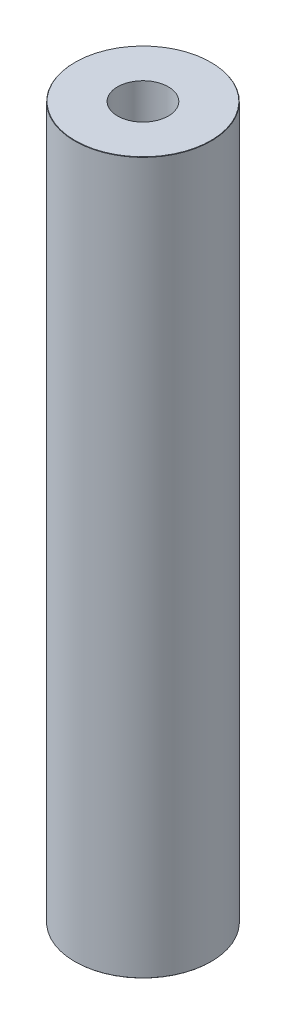
ISO-10303-21;
HEADER;
FILE_DESCRIPTION(('STEP AP214'),'2;1');
FILE_NAME('part.step','',(''),(''),'','','');
FILE_SCHEMA(('AUTOMOTIVE_DESIGN { 1 0 10303 214 1 1 1 1 }'));
ENDSEC;
DATA;
#1=APPLICATION_CONTEXT('core data for automotive mechanical design processes');
#2=APPLICATION_PROTOCOL_DEFINITION('international standard','automotive_design',2000,#1);
#3=PRODUCT_CONTEXT('',#1,'mechanical');
#4=PRODUCT('Part','Part','',(#3));
#5=PRODUCT_RELATED_PRODUCT_CATEGORY('part','',(#4));
#6=PRODUCT_DEFINITION_FORMATION('','',#4);
#7=PRODUCT_DEFINITION_CONTEXT('part definition',#1,'design');
#8=PRODUCT_DEFINITION('design','',#6,#7);
#9=PRODUCT_DEFINITION_SHAPE('','',#8);
#10=(LENGTH_UNIT() NAMED_UNIT(*) SI_UNIT(.MILLI.,.METRE.));
#11=(NAMED_UNIT(*) PLANE_ANGLE_UNIT() SI_UNIT($,.RADIAN.));
#12=(NAMED_UNIT(*) SI_UNIT($,.STERADIAN.) SOLID_ANGLE_UNIT());
#13=UNCERTAINTY_MEASURE_WITH_UNIT(LENGTH_MEASURE(1.E-05),#10,'distance_accuracy_value','');
#14=(GEOMETRIC_REPRESENTATION_CONTEXT(3) GLOBAL_UNCERTAINTY_ASSIGNED_CONTEXT((#13)) GLOBAL_UNIT_ASSIGNED_CONTEXT((#10,
#11,#12)) REPRESENTATION_CONTEXT('',''));
#15=CARTESIAN_POINT('',(0.,0.,0.));
#16=DIRECTION('',(0.,0.,1.));
#17=DIRECTION('',(1.,0.,0.));
#18=AXIS2_PLACEMENT_3D('',#15,#16,#17);
#19=CARTESIAN_POINT('',(0.,600.,0.));
#20=DIRECTION('',(0.,-1.,0.));
#21=DIRECTION('',(0.,0.,-1.));
#22=AXIS2_PLACEMENT_3D('',#19,#20,#21);
#23=CYLINDRICAL_SURFACE('',#22,57.5);
#24=CARTESIAN_POINT('',(0.,599.750846496673,0.));
#25=DIRECTION('',(0.,1.,0.));
#26=DIRECTION('',(0.,0.,1.));
#27=AXIS2_PLACEMENT_3D('',#24,#25,#26);
#28=CIRCLE('',#27,57.5);
#29=CARTESIAN_POINT('',(0.,599.750846496673,57.5));
#30=VERTEX_POINT('',#29);
#31=EDGE_CURVE('E50',#30,#30,#28,.F.);
#32=ORIENTED_EDGE('',*,*,#31,.T.);
#33=EDGE_LOOP('',(#32));
#34=FACE_BOUND('',#33,.T.);
#35=CARTESIAN_POINT('',(0.,0.249153503327326,0.));
#36=DIRECTION('',(0.,1.,0.));
#37=DIRECTION('',(0.,0.,1.));
#38=AXIS2_PLACEMENT_3D('',#35,#36,#37);
#39=CIRCLE('',#38,57.5);
#40=CARTESIAN_POINT('',(0.,0.249153503327326,57.5));
#41=VERTEX_POINT('',#40);
#42=EDGE_CURVE('E51',#41,#41,#39,.T.);
#43=ORIENTED_EDGE('',*,*,#42,.T.);
#44=EDGE_LOOP('',(#43));
#45=FACE_BOUND('',#44,.T.);
#46=ADVANCED_FACE('F39',(#34,#45),#23,.T.);
#47=CARTESIAN_POINT('',(0.,600.,0.));
#48=DIRECTION('',(0.,1.,0.));
#49=DIRECTION('',(0.,0.,1.));
#50=AXIS2_PLACEMENT_3D('',#47,#48,#49);
#51=PLANE('',#50);
#52=CARTESIAN_POINT('',(0.,600.,0.));
#53=DIRECTION('',(0.,1.,0.));
#54=DIRECTION('',(0.,0.,1.));
#55=AXIS2_PLACEMENT_3D('',#52,#53,#54);
#56=CIRCLE('',#55,57.2508464966726);
#57=CARTESIAN_POINT('',(0.,600.,57.2508464966726));
#58=VERTEX_POINT('',#57);
#59=EDGE_CURVE('E54',#58,#58,#56,.T.);
#60=ORIENTED_EDGE('',*,*,#59,.T.);
#61=EDGE_LOOP('',(#60));
#62=FACE_BOUND('',#61,.T.);
#63=CARTESIAN_POINT('',(0.,600.,0.));
#64=DIRECTION('',(0.,1.,0.));
#65=DIRECTION('',(0.,0.,1.));
#66=AXIS2_PLACEMENT_3D('',#63,#64,#65);
#67=CIRCLE('',#66,21.407007125602);
#68=CARTESIAN_POINT('',(0.,600.,21.407007125602));
#69=VERTEX_POINT('',#68);
#70=EDGE_CURVE('E58',#69,#69,#67,.T.);
#71=ORIENTED_EDGE('',*,*,#70,.F.);
#72=EDGE_LOOP('',(#71));
#73=FACE_BOUND('',#72,.T.);
#74=ADVANCED_FACE('F69',(#62,#73),#51,.T.);
#75=CARTESIAN_POINT('',(0.,0.,0.));
#76=DIRECTION('',(0.,1.,0.));
#77=DIRECTION('',(0.,0.,1.));
#78=AXIS2_PLACEMENT_3D('',#75,#76,#77);
#79=PLANE('',#78);
#80=CARTESIAN_POINT('',(0.,0.,0.));
#81=DIRECTION('',(0.,1.,0.));
#82=DIRECTION('',(0.,0.,1.));
#83=AXIS2_PLACEMENT_3D('',#80,#81,#82);
#84=CIRCLE('',#83,57.2508464966727);
#85=CARTESIAN_POINT('',(0.,0.,57.2508464966727));
#86=VERTEX_POINT('',#85);
#87=EDGE_CURVE('E10',#86,#86,#84,.F.);
#88=ORIENTED_EDGE('',*,*,#87,.T.);
#89=EDGE_LOOP('',(#88));
#90=FACE_BOUND('',#89,.T.);
#91=CARTESIAN_POINT('',(0.,0.,0.));
#92=DIRECTION('',(0.,1.,0.));
#93=DIRECTION('',(0.,0.,1.));
#94=AXIS2_PLACEMENT_3D('',#91,#92,#93);
#95=CIRCLE('',#94,21.407007125602);
#96=CARTESIAN_POINT('',(0.,0.,21.407007125602));
#97=VERTEX_POINT('',#96);
#98=EDGE_CURVE('E63',#97,#97,#95,.T.);
#99=ORIENTED_EDGE('',*,*,#98,.T.);
#100=EDGE_LOOP('',(#99));
#101=FACE_BOUND('',#100,.T.);
#102=ADVANCED_FACE('F75',(#90,#101),#79,.F.);
#103=CARTESIAN_POINT('',(0.,600.,0.));
#104=DIRECTION('',(0.,-1.,0.));
#105=DIRECTION('',(0.,0.,-1.));
#106=AXIS2_PLACEMENT_3D('',#103,#104,#105);
#107=CYLINDRICAL_SURFACE('',#106,21.407007125602);
#108=ORIENTED_EDGE('',*,*,#70,.T.);
#109=EDGE_LOOP('',(#108));
#110=FACE_BOUND('',#109,.T.);
#111=ORIENTED_EDGE('',*,*,#98,.F.);
#112=EDGE_LOOP('',(#111));
#113=FACE_BOUND('',#112,.T.);
#114=ADVANCED_FACE('F70',(#110,#113),#107,.F.);
#115=CARTESIAN_POINT('',(0.,600.,0.));
#116=DIRECTION('',(0.,-1.,0.));
#117=DIRECTION('',(0.,0.,-1.));
#118=AXIS2_PLACEMENT_3D('',#115,#116,#117);
#119=CONICAL_SURFACE('',#118,57.2508464966726,0.785398163397588);
#120=ORIENTED_EDGE('',*,*,#31,.F.);
#121=EDGE_LOOP('',(#120));
#122=FACE_BOUND('',#121,.T.);
#123=ORIENTED_EDGE('',*,*,#59,.F.);
#124=EDGE_LOOP('',(#123));
#125=FACE_BOUND('',#124,.T.);
#126=ADVANCED_FACE('F81',(#122,#125),#119,.T.);
#127=CARTESIAN_POINT('',(0.,0.249153503327326,0.));
#128=DIRECTION('',(0.,1.,0.));
#129=DIRECTION('',(0.,0.,1.));
#130=AXIS2_PLACEMENT_3D('',#127,#128,#129);
#131=CONICAL_SURFACE('',#130,57.5,0.785398163397448);
#132=ORIENTED_EDGE('',*,*,#87,.F.);
#133=EDGE_LOOP('',(#132));
#134=FACE_BOUND('',#133,.T.);
#135=ORIENTED_EDGE('',*,*,#42,.F.);
#136=EDGE_LOOP('',(#135));
#137=FACE_BOUND('',#136,.T.);
#138=ADVANCED_FACE('F45',(#134,#137),#131,.T.);
#139=CLOSED_SHELL('',(#46,#74,#102,#114,#126,#138));
#140=MANIFOLD_SOLID_BREP('B2',#139);
#141=ADVANCED_BREP_SHAPE_REPRESENTATION('',(#18,#140),#14);
#142=SHAPE_DEFINITION_REPRESENTATION(#9,#141);
ENDSEC;
END-ISO-10303-21;
